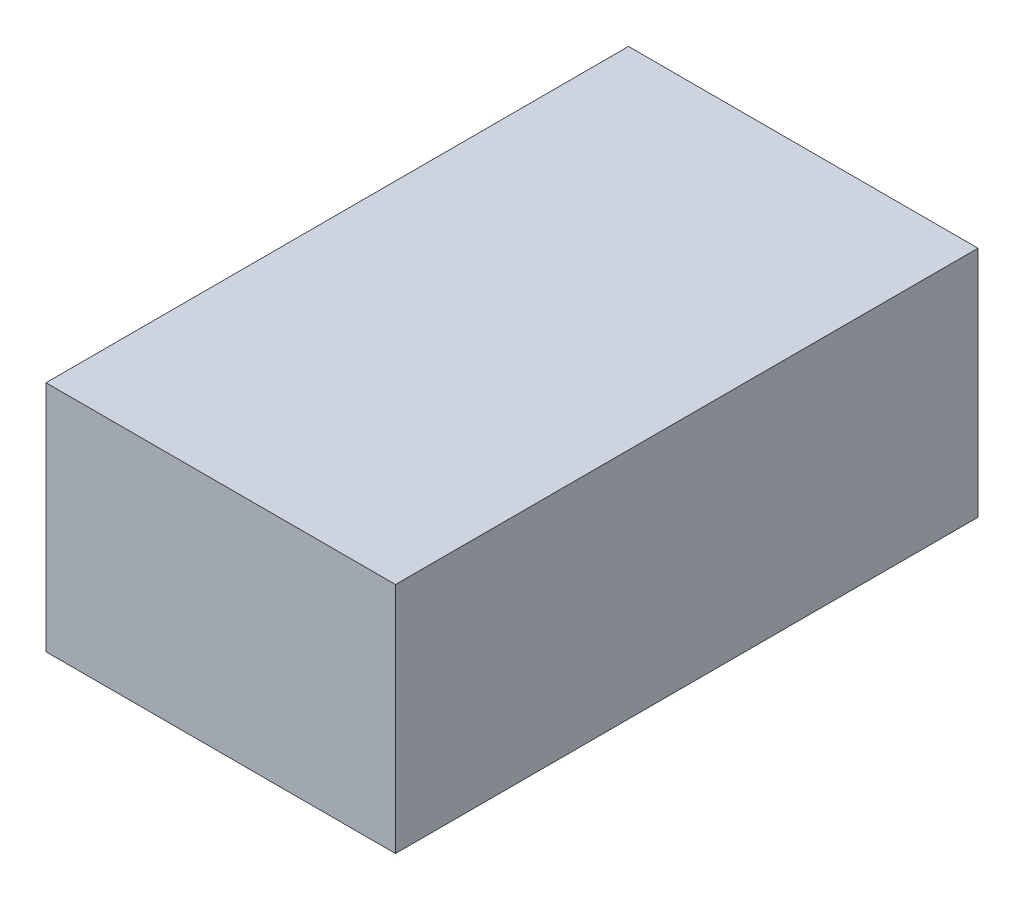
ISO-10303-21;
HEADER;
FILE_DESCRIPTION(('STEP AP214'),'2;1');
FILE_NAME('part.step','',(''),(''),'','','');
FILE_SCHEMA(('AUTOMOTIVE_DESIGN { 1 0 10303 214 1 1 1 1 }'));
ENDSEC;
DATA;
#1=APPLICATION_CONTEXT('core data for automotive mechanical design processes');
#2=APPLICATION_PROTOCOL_DEFINITION('international standard','automotive_design',2000,#1);
#3=PRODUCT_CONTEXT('',#1,'mechanical');
#4=PRODUCT('Part','Part','',(#3));
#5=PRODUCT_RELATED_PRODUCT_CATEGORY('part','',(#4));
#6=PRODUCT_DEFINITION_FORMATION('','',#4);
#7=PRODUCT_DEFINITION_CONTEXT('part definition',#1,'design');
#8=PRODUCT_DEFINITION('design','',#6,#7);
#9=PRODUCT_DEFINITION_SHAPE('','',#8);
#10=(LENGTH_UNIT() NAMED_UNIT(*) SI_UNIT(.MILLI.,.METRE.));
#11=(NAMED_UNIT(*) PLANE_ANGLE_UNIT() SI_UNIT($,.RADIAN.));
#12=(NAMED_UNIT(*) SI_UNIT($,.STERADIAN.) SOLID_ANGLE_UNIT());
#13=UNCERTAINTY_MEASURE_WITH_UNIT(LENGTH_MEASURE(1.E-05),#10,'distance_accuracy_value','');
#14=(GEOMETRIC_REPRESENTATION_CONTEXT(3) GLOBAL_UNCERTAINTY_ASSIGNED_CONTEXT((#13)) GLOBAL_UNIT_ASSIGNED_CONTEXT((#10,
#11,#12)) REPRESENTATION_CONTEXT('',''));
#15=CARTESIAN_POINT('',(0.,0.,0.));
#16=DIRECTION('',(0.,0.,1.));
#17=DIRECTION('',(1.,0.,0.));
#18=AXIS2_PLACEMENT_3D('',#15,#16,#17);
#19=CARTESIAN_POINT('',(0.3,0.4,-0.5));
#20=DIRECTION('',(-1.,0.,0.));
#21=DIRECTION('',(0.,0.,1.));
#22=AXIS2_PLACEMENT_3D('',#19,#20,#21);
#23=PLANE('',#22);
#24=DIRECTION('',(0.,0.,-1.));
#25=VECTOR('',#24,1.);
#26=CARTESIAN_POINT('',(0.3,0.,-0.5));
#27=LINE('',#26,#25);
#28=CARTESIAN_POINT('',(0.3,0.,0.5));
#29=VERTEX_POINT('',#28);
#30=CARTESIAN_POINT('',(0.3,0.,-0.5));
#31=VERTEX_POINT('',#30);
#32=EDGE_CURVE('E95',#29,#31,#27,.T.);
#33=ORIENTED_EDGE('',*,*,#32,.T.);
#34=DIRECTION('',(0.,-1.,0.));
#35=VECTOR('',#34,1.);
#36=CARTESIAN_POINT('',(0.3,0.4,-0.5));
#37=LINE('',#36,#35);
#38=CARTESIAN_POINT('',(0.3,0.4,-0.5));
#39=VERTEX_POINT('',#38);
#40=EDGE_CURVE('E11',#39,#31,#37,.T.);
#41=ORIENTED_EDGE('',*,*,#40,.F.);
#42=DIRECTION('',(0.,0.,-1.));
#43=VECTOR('',#42,1.);
#44=CARTESIAN_POINT('',(0.3,0.4,-0.5));
#45=LINE('',#44,#43);
#46=CARTESIAN_POINT('',(0.3,0.4,0.5));
#47=VERTEX_POINT('',#46);
#48=EDGE_CURVE('E83',#47,#39,#45,.T.);
#49=ORIENTED_EDGE('',*,*,#48,.F.);
#50=DIRECTION('',(0.,-1.,0.));
#51=VECTOR('',#50,1.);
#52=CARTESIAN_POINT('',(0.3,0.4,0.5));
#53=LINE('',#52,#51);
#54=EDGE_CURVE('E91',#47,#29,#53,.T.);
#55=ORIENTED_EDGE('',*,*,#54,.T.);
#56=EDGE_LOOP('',(#33,#41,#49,#55));
#57=FACE_BOUND('',#56,.T.);
#58=ADVANCED_FACE('F32',(#57),#23,.F.);
#59=CARTESIAN_POINT('',(-0.3,0.4,-0.5));
#60=DIRECTION('',(0.,0.,1.));
#61=DIRECTION('',(1.,0.,0.));
#62=AXIS2_PLACEMENT_3D('',#59,#60,#61);
#63=PLANE('',#62);
#64=DIRECTION('',(-1.,0.,0.));
#65=VECTOR('',#64,1.);
#66=CARTESIAN_POINT('',(-0.3,0.,-0.5));
#67=LINE('',#66,#65);
#68=CARTESIAN_POINT('',(-0.3,0.,-0.5));
#69=VERTEX_POINT('',#68);
#70=EDGE_CURVE('E87',#31,#69,#67,.T.);
#71=ORIENTED_EDGE('',*,*,#70,.T.);
#72=DIRECTION('',(0.,-1.,0.));
#73=VECTOR('',#72,1.);
#74=CARTESIAN_POINT('',(-0.3,0.4,-0.5));
#75=LINE('',#74,#73);
#76=CARTESIAN_POINT('',(-0.3,0.4,-0.5));
#77=VERTEX_POINT('',#76);
#78=EDGE_CURVE('E40',#77,#69,#75,.T.);
#79=ORIENTED_EDGE('',*,*,#78,.F.);
#80=DIRECTION('',(-1.,0.,0.));
#81=VECTOR('',#80,1.);
#82=CARTESIAN_POINT('',(-0.3,0.4,-0.5));
#83=LINE('',#82,#81);
#84=EDGE_CURVE('E78',#39,#77,#83,.T.);
#85=ORIENTED_EDGE('',*,*,#84,.F.);
#86=ORIENTED_EDGE('',*,*,#40,.T.);
#87=EDGE_LOOP('',(#71,#79,#85,#86));
#88=FACE_BOUND('',#87,.T.);
#89=ADVANCED_FACE('F86',(#88),#63,.F.);
#90=CARTESIAN_POINT('',(-0.3,0.4,-0.5));
#91=DIRECTION('',(1.,0.,0.));
#92=DIRECTION('',(0.,0.,-1.));
#93=AXIS2_PLACEMENT_3D('',#90,#91,#92);
#94=PLANE('',#93);
#95=DIRECTION('',(0.,0.,1.));
#96=VECTOR('',#95,1.);
#97=CARTESIAN_POINT('',(-0.3,0.,-0.5));
#98=LINE('',#97,#96);
#99=CARTESIAN_POINT('',(-0.3,0.,0.5));
#100=VERTEX_POINT('',#99);
#101=EDGE_CURVE('E65',#69,#100,#98,.T.);
#102=ORIENTED_EDGE('',*,*,#101,.T.);
#103=DIRECTION('',(0.,-1.,0.));
#104=VECTOR('',#103,1.);
#105=CARTESIAN_POINT('',(-0.3,0.4,0.5));
#106=LINE('',#105,#104);
#107=CARTESIAN_POINT('',(-0.3,0.4,0.5));
#108=VERTEX_POINT('',#107);
#109=EDGE_CURVE('E88',#108,#100,#106,.T.);
#110=ORIENTED_EDGE('',*,*,#109,.F.);
#111=DIRECTION('',(0.,0.,1.));
#112=VECTOR('',#111,1.);
#113=CARTESIAN_POINT('',(-0.3,0.4,-0.5));
#114=LINE('',#113,#112);
#115=EDGE_CURVE('E81',#77,#108,#114,.T.);
#116=ORIENTED_EDGE('',*,*,#115,.F.);
#117=ORIENTED_EDGE('',*,*,#78,.T.);
#118=EDGE_LOOP('',(#102,#110,#116,#117));
#119=FACE_BOUND('',#118,.T.);
#120=ADVANCED_FACE('F89',(#119),#94,.F.);
#121=CARTESIAN_POINT('',(-0.3,0.4,0.5));
#122=DIRECTION('',(0.,0.,-1.));
#123=DIRECTION('',(-1.,0.,0.));
#124=AXIS2_PLACEMENT_3D('',#121,#122,#123);
#125=PLANE('',#124);
#126=DIRECTION('',(1.,0.,0.));
#127=VECTOR('',#126,1.);
#128=CARTESIAN_POINT('',(-0.3,0.,0.5));
#129=LINE('',#128,#127);
#130=EDGE_CURVE('E71',#100,#29,#129,.T.);
#131=ORIENTED_EDGE('',*,*,#130,.T.);
#132=ORIENTED_EDGE('',*,*,#54,.F.);
#133=DIRECTION('',(1.,0.,0.));
#134=VECTOR('',#133,1.);
#135=CARTESIAN_POINT('',(-0.3,0.4,0.5));
#136=LINE('',#135,#134);
#137=EDGE_CURVE('E48',#108,#47,#136,.T.);
#138=ORIENTED_EDGE('',*,*,#137,.F.);
#139=ORIENTED_EDGE('',*,*,#109,.T.);
#140=EDGE_LOOP('',(#131,#132,#138,#139));
#141=FACE_BOUND('',#140,.T.);
#142=ADVANCED_FACE('F102',(#141),#125,.F.);
#143=CARTESIAN_POINT('',(0.,0.4,0.));
#144=DIRECTION('',(0.,1.,0.));
#145=DIRECTION('',(0.,0.,1.));
#146=AXIS2_PLACEMENT_3D('',#143,#144,#145);
#147=PLANE('',#146);
#148=ORIENTED_EDGE('',*,*,#48,.T.);
#149=ORIENTED_EDGE('',*,*,#84,.T.);
#150=ORIENTED_EDGE('',*,*,#115,.T.);
#151=ORIENTED_EDGE('',*,*,#137,.T.);
#152=EDGE_LOOP('',(#148,#149,#150,#151));
#153=FACE_BOUND('',#152,.T.);
#154=ADVANCED_FACE('F79',(#153),#147,.T.);
#155=CARTESIAN_POINT('',(0.,0.,0.));
#156=DIRECTION('',(0.,1.,0.));
#157=DIRECTION('',(0.,0.,1.));
#158=AXIS2_PLACEMENT_3D('',#155,#156,#157);
#159=PLANE('',#158);
#160=ORIENTED_EDGE('',*,*,#32,.F.);
#161=ORIENTED_EDGE('',*,*,#130,.F.);
#162=ORIENTED_EDGE('',*,*,#101,.F.);
#163=ORIENTED_EDGE('',*,*,#70,.F.);
#164=EDGE_LOOP('',(#160,#161,#162,#163));
#165=FACE_BOUND('',#164,.T.);
#166=ADVANCED_FACE('F105',(#165),#159,.F.);
#167=CLOSED_SHELL('',(#58,#89,#120,#142,#154,#166));
#168=MANIFOLD_SOLID_BREP('B2',#167);
#169=ADVANCED_BREP_SHAPE_REPRESENTATION('',(#18,#168),#14);
#170=SHAPE_DEFINITION_REPRESENTATION(#9,#169);
ENDSEC;
END-ISO-10303-21;
